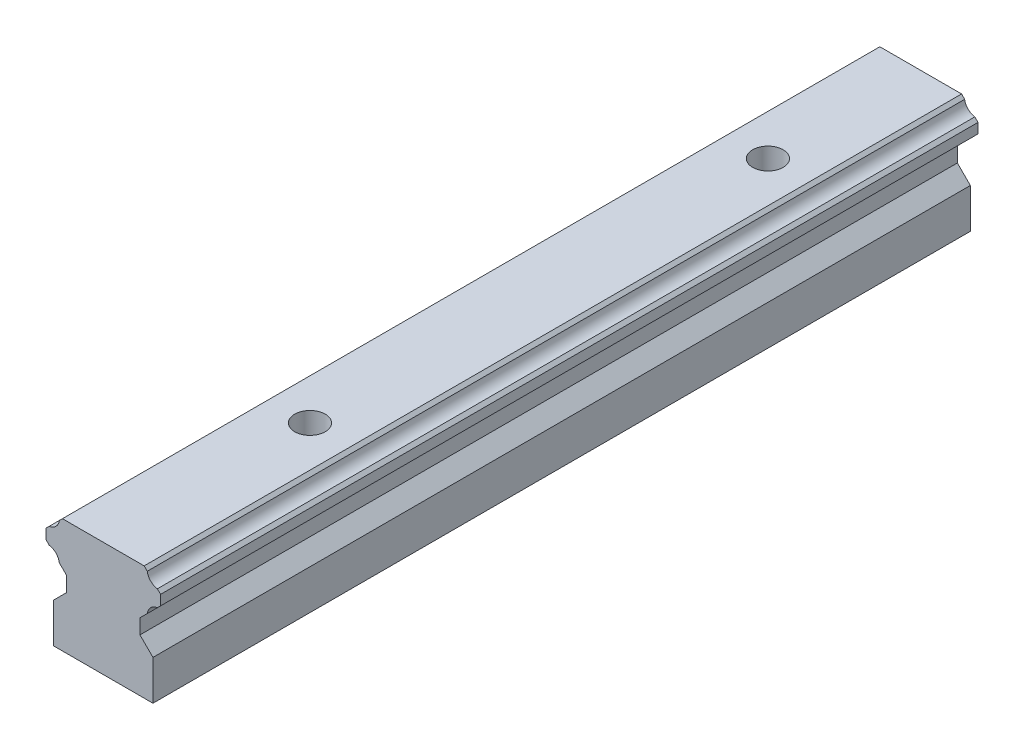
ISO-10303-21;
HEADER;
FILE_DESCRIPTION(('STEP AP214'),'2;1');
FILE_NAME('part.step','',(''),(''),'','','');
FILE_SCHEMA(('AUTOMOTIVE_DESIGN { 1 0 10303 214 1 1 1 1 }'));
ENDSEC;
DATA;
#1=APPLICATION_CONTEXT('core data for automotive mechanical design processes');
#2=APPLICATION_PROTOCOL_DEFINITION('international standard','automotive_design',2000,#1);
#3=PRODUCT_CONTEXT('',#1,'mechanical');
#4=PRODUCT('Part','Part','',(#3));
#5=PRODUCT_RELATED_PRODUCT_CATEGORY('part','',(#4));
#6=PRODUCT_DEFINITION_FORMATION('','',#4);
#7=PRODUCT_DEFINITION_CONTEXT('part definition',#1,'design');
#8=PRODUCT_DEFINITION('design','',#6,#7);
#9=PRODUCT_DEFINITION_SHAPE('','',#8);
#10=(LENGTH_UNIT() NAMED_UNIT(*) SI_UNIT(.MILLI.,.METRE.));
#11=(NAMED_UNIT(*) PLANE_ANGLE_UNIT() SI_UNIT($,.RADIAN.));
#12=(NAMED_UNIT(*) SI_UNIT($,.STERADIAN.) SOLID_ANGLE_UNIT());
#13=UNCERTAINTY_MEASURE_WITH_UNIT(LENGTH_MEASURE(1.E-05),#10,'distance_accuracy_value','');
#14=(GEOMETRIC_REPRESENTATION_CONTEXT(3) GLOBAL_UNCERTAINTY_ASSIGNED_CONTEXT((#13)) GLOBAL_UNIT_ASSIGNED_CONTEXT((#10,
#11,#12)) REPRESENTATION_CONTEXT('',''));
#15=CARTESIAN_POINT('',(0.,0.,0.));
#16=DIRECTION('',(0.,0.,1.));
#17=DIRECTION('',(1.,0.,0.));
#18=AXIS2_PLACEMENT_3D('',#15,#16,#17);
#19=CARTESIAN_POINT('',(-6.5,5.20000000000005,107.00004));
#20=DIRECTION('',(0.707106781186547,-0.707106781186547,0.));
#21=DIRECTION('',(0.707106781186548,0.707106781186548,0.));
#22=AXIS2_PLACEMENT_3D('',#19,#20,#21);
#23=PLANE('',#22);
#24=DIRECTION('',(-0.707106781186547,-0.707106781186547,0.));
#25=VECTOR('',#24,1.);
#26=CARTESIAN_POINT('',(-6.5,5.20000000000005,0.));
#27=LINE('',#26,#25);
#28=CARTESIAN_POINT('',(-4.8,6.90000000000005,0.));
#29=VERTEX_POINT('',#28);
#30=CARTESIAN_POINT('',(-6.5,5.20000000000005,0.));
#31=VERTEX_POINT('',#30);
#32=EDGE_CURVE('E214',#29,#31,#27,.T.);
#33=ORIENTED_EDGE('',*,*,#32,.T.);
#34=DIRECTION('',(0.,0.,-1.));
#35=VECTOR('',#34,1.);
#36=CARTESIAN_POINT('',(-6.5,5.20000000000005,107.00004));
#37=LINE('',#36,#35);
#38=CARTESIAN_POINT('',(-6.5,5.20000000000005,107.00004));
#39=VERTEX_POINT('',#38);
#40=EDGE_CURVE('E11',#39,#31,#37,.T.);
#41=ORIENTED_EDGE('',*,*,#40,.F.);
#42=DIRECTION('',(-0.707106781186547,-0.707106781186547,0.));
#43=VECTOR('',#42,1.);
#44=CARTESIAN_POINT('',(-6.5,5.20000000000005,107.00004));
#45=LINE('',#44,#43);
#46=CARTESIAN_POINT('',(-4.8,6.90000000000005,107.00004));
#47=VERTEX_POINT('',#46);
#48=EDGE_CURVE('E257',#47,#39,#45,.T.);
#49=ORIENTED_EDGE('',*,*,#48,.F.);
#50=DIRECTION('',(0.,0.,-1.));
#51=VECTOR('',#50,1.);
#52=CARTESIAN_POINT('',(-4.8,6.90000000000005,107.00004));
#53=LINE('',#52,#51);
#54=EDGE_CURVE('E210',#47,#29,#53,.T.);
#55=ORIENTED_EDGE('',*,*,#54,.T.);
#56=EDGE_LOOP('',(#33,#41,#49,#55));
#57=FACE_BOUND('',#56,.T.);
#58=ADVANCED_FACE('F34',(#57),#23,.F.);
#59=CARTESIAN_POINT('',(-6.5,5.20000000000005,107.00004));
#60=DIRECTION('',(1.,0.,0.));
#61=DIRECTION('',(0.,0.,-1.));
#62=AXIS2_PLACEMENT_3D('',#59,#60,#61);
#63=PLANE('',#62);
#64=DIRECTION('',(0.,-1.,0.));
#65=VECTOR('',#64,1.);
#66=CARTESIAN_POINT('',(-6.5,5.20000000000005,0.));
#67=LINE('',#66,#65);
#68=CARTESIAN_POINT('',(-6.5,0.,0.));
#69=VERTEX_POINT('',#68);
#70=EDGE_CURVE('E217',#31,#69,#67,.T.);
#71=ORIENTED_EDGE('',*,*,#70,.T.);
#72=DIRECTION('',(0.,0.,-1.));
#73=VECTOR('',#72,1.);
#74=CARTESIAN_POINT('',(-6.5,0.,107.00004));
#75=LINE('',#74,#73);
#76=CARTESIAN_POINT('',(-6.5,0.,107.00004));
#77=VERTEX_POINT('',#76);
#78=EDGE_CURVE('E42',#77,#69,#75,.T.);
#79=ORIENTED_EDGE('',*,*,#78,.F.);
#80=DIRECTION('',(0.,-1.,0.));
#81=VECTOR('',#80,1.);
#82=CARTESIAN_POINT('',(-6.5,5.20000000000005,107.00004));
#83=LINE('',#82,#81);
#84=EDGE_CURVE('E135',#39,#77,#83,.T.);
#85=ORIENTED_EDGE('',*,*,#84,.F.);
#86=ORIENTED_EDGE('',*,*,#40,.T.);
#87=EDGE_LOOP('',(#71,#79,#85,#86));
#88=FACE_BOUND('',#87,.T.);
#89=ADVANCED_FACE('F385',(#88),#63,.F.);
#90=CARTESIAN_POINT('',(-6.5,0.,107.00004));
#91=DIRECTION('',(0.,1.,0.));
#92=DIRECTION('',(0.,0.,1.));
#93=AXIS2_PLACEMENT_3D('',#90,#91,#92);
#94=PLANE('',#93);
#95=CARTESIAN_POINT('',(0.,0.,20.));
#96=DIRECTION('',(0.,1.,0.));
#97=DIRECTION('',(0.,0.,1.));
#98=AXIS2_PLACEMENT_3D('',#95,#96,#97);
#99=CIRCLE('',#98,2.);
#100=CARTESIAN_POINT('',(0.,0.,22.));
#101=VERTEX_POINT('',#100);
#102=EDGE_CURVE('E218',#101,#101,#99,.T.);
#103=ORIENTED_EDGE('',*,*,#102,.T.);
#104=EDGE_LOOP('',(#103));
#105=FACE_BOUND('',#104,.T.);
#106=CARTESIAN_POINT('',(0.,0.,79.944));
#107=DIRECTION('',(0.,1.,0.));
#108=DIRECTION('',(0.,0.,1.));
#109=AXIS2_PLACEMENT_3D('',#106,#107,#108);
#110=CIRCLE('',#109,2.);
#111=CARTESIAN_POINT('',(0.,0.,81.944));
#112=VERTEX_POINT('',#111);
#113=EDGE_CURVE('E523',#112,#112,#110,.T.);
#114=ORIENTED_EDGE('',*,*,#113,.T.);
#115=EDGE_LOOP('',(#114));
#116=FACE_BOUND('',#115,.T.);
#117=DIRECTION('',(1.,0.,0.));
#118=VECTOR('',#117,1.);
#119=CARTESIAN_POINT('',(-6.5,0.,0.));
#120=LINE('',#119,#118);
#121=CARTESIAN_POINT('',(6.5,0.,0.));
#122=VERTEX_POINT('',#121);
#123=EDGE_CURVE('E220',#69,#122,#120,.T.);
#124=ORIENTED_EDGE('',*,*,#123,.T.);
#125=DIRECTION('',(0.,0.,-1.));
#126=VECTOR('',#125,1.);
#127=CARTESIAN_POINT('',(6.5,0.,107.00004));
#128=LINE('',#127,#126);
#129=CARTESIAN_POINT('',(6.5,0.,107.00004));
#130=VERTEX_POINT('',#129);
#131=EDGE_CURVE('E306',#130,#122,#128,.T.);
#132=ORIENTED_EDGE('',*,*,#131,.F.);
#133=DIRECTION('',(1.,0.,0.));
#134=VECTOR('',#133,1.);
#135=CARTESIAN_POINT('',(-6.5,0.,107.00004));
#136=LINE('',#135,#134);
#137=EDGE_CURVE('E314',#77,#130,#136,.T.);
#138=ORIENTED_EDGE('',*,*,#137,.F.);
#139=ORIENTED_EDGE('',*,*,#78,.T.);
#140=EDGE_LOOP('',(#124,#132,#138,#139));
#141=FACE_BOUND('',#140,.T.);
#142=ADVANCED_FACE('F312',(#105,#116,#141),#94,.F.);
#143=CARTESIAN_POINT('',(6.5,5.20000000000005,107.00004));
#144=DIRECTION('',(-1.,0.,0.));
#145=DIRECTION('',(0.,0.,1.));
#146=AXIS2_PLACEMENT_3D('',#143,#144,#145);
#147=PLANE('',#146);
#148=DIRECTION('',(0.,1.,0.));
#149=VECTOR('',#148,1.);
#150=CARTESIAN_POINT('',(6.5,5.20000000000005,0.));
#151=LINE('',#150,#149);
#152=CARTESIAN_POINT('',(6.5,5.20000000000005,0.));
#153=VERTEX_POINT('',#152);
#154=EDGE_CURVE('E222',#122,#153,#151,.T.);
#155=ORIENTED_EDGE('',*,*,#154,.T.);
#156=DIRECTION('',(0.,0.,-1.));
#157=VECTOR('',#156,1.);
#158=CARTESIAN_POINT('',(6.5,5.20000000000005,107.00004));
#159=LINE('',#158,#157);
#160=CARTESIAN_POINT('',(6.5,5.20000000000005,107.00004));
#161=VERTEX_POINT('',#160);
#162=EDGE_CURVE('E303',#161,#153,#159,.T.);
#163=ORIENTED_EDGE('',*,*,#162,.F.);
#164=DIRECTION('',(0.,1.,0.));
#165=VECTOR('',#164,1.);
#166=CARTESIAN_POINT('',(6.5,5.20000000000005,107.00004));
#167=LINE('',#166,#165);
#168=EDGE_CURVE('E332',#130,#161,#167,.T.);
#169=ORIENTED_EDGE('',*,*,#168,.F.);
#170=ORIENTED_EDGE('',*,*,#131,.T.);
#171=EDGE_LOOP('',(#155,#163,#169,#170));
#172=FACE_BOUND('',#171,.T.);
#173=ADVANCED_FACE('F323',(#172),#147,.F.);
#174=CARTESIAN_POINT('',(4.8,6.90000000000005,107.00004));
#175=DIRECTION('',(-0.707106781186547,-0.707106781186547,0.));
#176=DIRECTION('',(0.707106781186548,-0.707106781186548,0.));
#177=AXIS2_PLACEMENT_3D('',#174,#175,#176);
#178=PLANE('',#177);
#179=DIRECTION('',(-0.707106781186547,0.707106781186547,0.));
#180=VECTOR('',#179,1.);
#181=CARTESIAN_POINT('',(4.8,6.90000000000005,0.));
#182=LINE('',#181,#180);
#183=CARTESIAN_POINT('',(4.8,6.90000000000005,0.));
#184=VERTEX_POINT('',#183);
#185=EDGE_CURVE('E224',#153,#184,#182,.T.);
#186=ORIENTED_EDGE('',*,*,#185,.T.);
#187=DIRECTION('',(0.,0.,-1.));
#188=VECTOR('',#187,1.);
#189=CARTESIAN_POINT('',(4.8,6.90000000000005,107.00004));
#190=LINE('',#189,#188);
#191=CARTESIAN_POINT('',(4.8,6.90000000000005,107.00004));
#192=VERTEX_POINT('',#191);
#193=EDGE_CURVE('E300',#192,#184,#190,.T.);
#194=ORIENTED_EDGE('',*,*,#193,.F.);
#195=DIRECTION('',(-0.707106781186547,0.707106781186547,0.));
#196=VECTOR('',#195,1.);
#197=CARTESIAN_POINT('',(4.8,6.90000000000005,107.00004));
#198=LINE('',#197,#196);
#199=EDGE_CURVE('E329',#161,#192,#198,.T.);
#200=ORIENTED_EDGE('',*,*,#199,.F.);
#201=ORIENTED_EDGE('',*,*,#162,.T.);
#202=EDGE_LOOP('',(#186,#194,#200,#201));
#203=FACE_BOUND('',#202,.T.);
#204=ADVANCED_FACE('F327',(#203),#178,.F.);
#205=CARTESIAN_POINT('',(4.8,8.84000000000005,107.00004));
#206=DIRECTION('',(-1.,0.,0.));
#207=DIRECTION('',(0.,0.,1.));
#208=AXIS2_PLACEMENT_3D('',#205,#206,#207);
#209=PLANE('',#208);
#210=DIRECTION('',(0.,1.,0.));
#211=VECTOR('',#210,1.);
#212=CARTESIAN_POINT('',(4.8,8.84000000000005,0.));
#213=LINE('',#212,#211);
#214=CARTESIAN_POINT('',(4.8,8.84000000000005,0.));
#215=VERTEX_POINT('',#214);
#216=EDGE_CURVE('E226',#184,#215,#213,.T.);
#217=ORIENTED_EDGE('',*,*,#216,.T.);
#218=DIRECTION('',(0.,0.,-1.));
#219=VECTOR('',#218,1.);
#220=CARTESIAN_POINT('',(4.8,8.84000000000005,107.00004));
#221=LINE('',#220,#219);
#222=CARTESIAN_POINT('',(4.8,8.84000000000005,107.00004));
#223=VERTEX_POINT('',#222);
#224=EDGE_CURVE('E297',#223,#215,#221,.T.);
#225=ORIENTED_EDGE('',*,*,#224,.F.);
#226=DIRECTION('',(0.,1.,0.));
#227=VECTOR('',#226,1.);
#228=CARTESIAN_POINT('',(4.8,8.84000000000005,107.00004));
#229=LINE('',#228,#227);
#230=EDGE_CURVE('E331',#192,#223,#229,.T.);
#231=ORIENTED_EDGE('',*,*,#230,.F.);
#232=ORIENTED_EDGE('',*,*,#193,.T.);
#233=EDGE_LOOP('',(#217,#225,#231,#232));
#234=FACE_BOUND('',#233,.T.);
#235=ADVANCED_FACE('F399',(#234),#209,.F.);
#236=CARTESIAN_POINT('',(5.7548684340674,9.79486843406745,107.00004));
#237=DIRECTION('',(-0.707106781186548,0.707106781186547,0.));
#238=DIRECTION('',(-0.707106781186547,-0.707106781186548,0.));
#239=AXIS2_PLACEMENT_3D('',#236,#237,#238);
#240=PLANE('',#239);
#241=DIRECTION('',(0.707106781186547,0.707106781186548,0.));
#242=VECTOR('',#241,1.);
#243=CARTESIAN_POINT('',(5.7548684340674,9.79486843406745,0.));
#244=LINE('',#243,#242);
#245=CARTESIAN_POINT('',(5.7548684340674,9.79486843406745,0.));
#246=VERTEX_POINT('',#245);
#247=EDGE_CURVE('E228',#215,#246,#244,.T.);
#248=ORIENTED_EDGE('',*,*,#247,.T.);
#249=DIRECTION('',(0.,0.,-1.));
#250=VECTOR('',#249,1.);
#251=CARTESIAN_POINT('',(5.7548684340674,9.79486843406745,107.00004));
#252=LINE('',#251,#250);
#253=CARTESIAN_POINT('',(5.7548684340674,9.79486843406745,107.00004));
#254=VERTEX_POINT('',#253);
#255=EDGE_CURVE('E294',#254,#246,#252,.T.);
#256=ORIENTED_EDGE('',*,*,#255,.F.);
#257=DIRECTION('',(0.707106781186547,0.707106781186548,0.));
#258=VECTOR('',#257,1.);
#259=CARTESIAN_POINT('',(5.7548684340674,9.79486843406745,107.00004));
#260=LINE('',#259,#258);
#261=EDGE_CURVE('E334',#223,#254,#260,.T.);
#262=ORIENTED_EDGE('',*,*,#261,.F.);
#263=ORIENTED_EDGE('',*,*,#224,.T.);
#264=EDGE_LOOP('',(#248,#256,#262,#263));
#265=FACE_BOUND('',#264,.T.);
#266=ADVANCED_FACE('F402',(#265),#240,.F.);
#267=CARTESIAN_POINT('',(7.29999999999997,9.58000000000008,107.00004));
#268=DIRECTION('',(0.,0.,-1.));
#269=DIRECTION('',(-1.,0.,0.));
#270=AXIS2_PLACEMENT_3D('',#267,#268,#269);
#271=CYLINDRICAL_SURFACE('',#270,1.55999999999993);
#272=CARTESIAN_POINT('',(7.29999999999997,9.58000000000008,0.));
#273=DIRECTION('',(0.,0.,-1.));
#274=DIRECTION('',(1.,0.,0.));
#275=AXIS2_PLACEMENT_3D('',#272,#273,#274);
#276=CIRCLE('',#275,1.55999999999993);
#277=CARTESIAN_POINT('',(7.0851315659326,11.1251315659326,0.));
#278=VERTEX_POINT('',#277);
#279=EDGE_CURVE('E230',#246,#278,#276,.T.);
#280=ORIENTED_EDGE('',*,*,#279,.T.);
#281=DIRECTION('',(0.,0.,-1.));
#282=VECTOR('',#281,1.);
#283=CARTESIAN_POINT('',(7.0851315659326,11.1251315659326,107.00004));
#284=LINE('',#283,#282);
#285=CARTESIAN_POINT('',(7.0851315659326,11.1251315659326,107.00004));
#286=VERTEX_POINT('',#285);
#287=EDGE_CURVE('E291',#286,#278,#284,.T.);
#288=ORIENTED_EDGE('',*,*,#287,.F.);
#289=CARTESIAN_POINT('',(7.29999999999997,9.58000000000008,107.00004));
#290=DIRECTION('',(0.,0.,-1.));
#291=DIRECTION('',(1.,0.,0.));
#292=AXIS2_PLACEMENT_3D('',#289,#290,#291);
#293=CIRCLE('',#292,1.55999999999993);
#294=EDGE_CURVE('E340',#254,#286,#293,.T.);
#295=ORIENTED_EDGE('',*,*,#294,.F.);
#296=ORIENTED_EDGE('',*,*,#255,.T.);
#297=EDGE_LOOP('',(#280,#288,#295,#296));
#298=FACE_BOUND('',#297,.T.);
#299=ADVANCED_FACE('F406',(#298),#271,.F.);
#300=CARTESIAN_POINT('',(7.5,11.54,107.00004));
#301=DIRECTION('',(-0.707106781186548,0.707106781186547,0.));
#302=DIRECTION('',(-0.707106781186547,-0.707106781186548,0.));
#303=AXIS2_PLACEMENT_3D('',#300,#301,#302);
#304=PLANE('',#303);
#305=DIRECTION('',(0.707106781186547,0.707106781186548,0.));
#306=VECTOR('',#305,1.);
#307=CARTESIAN_POINT('',(7.5,11.54,0.));
#308=LINE('',#307,#306);
#309=CARTESIAN_POINT('',(7.5,11.54,0.));
#310=VERTEX_POINT('',#309);
#311=EDGE_CURVE('E232',#278,#310,#308,.T.);
#312=ORIENTED_EDGE('',*,*,#311,.T.);
#313=DIRECTION('',(0.,0.,-1.));
#314=VECTOR('',#313,1.);
#315=CARTESIAN_POINT('',(7.5,11.54,107.00004));
#316=LINE('',#315,#314);
#317=CARTESIAN_POINT('',(7.5,11.54,107.00004));
#318=VERTEX_POINT('',#317);
#319=EDGE_CURVE('E288',#318,#310,#316,.T.);
#320=ORIENTED_EDGE('',*,*,#319,.F.);
#321=DIRECTION('',(0.707106781186547,0.707106781186548,0.));
#322=VECTOR('',#321,1.);
#323=CARTESIAN_POINT('',(7.5,11.54,107.00004));
#324=LINE('',#323,#322);
#325=EDGE_CURVE('E342',#286,#318,#324,.T.);
#326=ORIENTED_EDGE('',*,*,#325,.F.);
#327=ORIENTED_EDGE('',*,*,#287,.T.);
#328=EDGE_LOOP('',(#312,#320,#326,#327));
#329=FACE_BOUND('',#328,.T.);
#330=ADVANCED_FACE('F410',(#329),#304,.F.);
#331=CARTESIAN_POINT('',(7.5,12.85,107.00004));
#332=DIRECTION('',(-1.,0.,0.));
#333=DIRECTION('',(0.,0.,1.));
#334=AXIS2_PLACEMENT_3D('',#331,#332,#333);
#335=PLANE('',#334);
#336=DIRECTION('',(0.,1.,0.));
#337=VECTOR('',#336,1.);
#338=CARTESIAN_POINT('',(7.5,12.85,0.));
#339=LINE('',#338,#337);
#340=CARTESIAN_POINT('',(7.5,12.85,0.));
#341=VERTEX_POINT('',#340);
#342=EDGE_CURVE('E234',#310,#341,#339,.T.);
#343=ORIENTED_EDGE('',*,*,#342,.T.);
#344=DIRECTION('',(0.,0.,-1.));
#345=VECTOR('',#344,1.);
#346=CARTESIAN_POINT('',(7.5,12.85,107.00004));
#347=LINE('',#346,#345);
#348=CARTESIAN_POINT('',(7.5,12.85,107.00004));
#349=VERTEX_POINT('',#348);
#350=EDGE_CURVE('E285',#349,#341,#347,.T.);
#351=ORIENTED_EDGE('',*,*,#350,.F.);
#352=DIRECTION('',(0.,1.,0.));
#353=VECTOR('',#352,1.);
#354=CARTESIAN_POINT('',(7.5,12.85,107.00004));
#355=LINE('',#354,#353);
#356=EDGE_CURVE('E344',#318,#349,#355,.T.);
#357=ORIENTED_EDGE('',*,*,#356,.F.);
#358=ORIENTED_EDGE('',*,*,#319,.T.);
#359=EDGE_LOOP('',(#343,#351,#357,#358));
#360=FACE_BOUND('',#359,.T.);
#361=ADVANCED_FACE('F414',(#360),#335,.F.);
#362=CARTESIAN_POINT('',(7.0816423301223,13.2683576698777,107.00004));
#363=DIRECTION('',(-0.707106781186549,-0.707106781186546,0.));
#364=DIRECTION('',(0.707106781186546,-0.707106781186549,0.));
#365=AXIS2_PLACEMENT_3D('',#362,#363,#364);
#366=PLANE('',#365);
#367=DIRECTION('',(-0.707106781186546,0.707106781186549,0.));
#368=VECTOR('',#367,1.);
#369=CARTESIAN_POINT('',(7.0816423301223,13.2683576698777,0.));
#370=LINE('',#369,#368);
#371=CARTESIAN_POINT('',(7.0816423301223,13.2683576698777,0.));
#372=VERTEX_POINT('',#371);
#373=EDGE_CURVE('E236',#341,#372,#370,.T.);
#374=ORIENTED_EDGE('',*,*,#373,.T.);
#375=DIRECTION('',(0.,0.,-1.));
#376=VECTOR('',#375,1.);
#377=CARTESIAN_POINT('',(7.0816423301223,13.2683576698777,107.00004));
#378=LINE('',#377,#376);
#379=CARTESIAN_POINT('',(7.0816423301223,13.2683576698777,107.00004));
#380=VERTEX_POINT('',#379);
#381=EDGE_CURVE('E282',#380,#372,#378,.T.);
#382=ORIENTED_EDGE('',*,*,#381,.F.);
#383=DIRECTION('',(-0.707106781186546,0.707106781186549,0.));
#384=VECTOR('',#383,1.);
#385=CARTESIAN_POINT('',(7.0816423301223,13.2683576698777,107.00004));
#386=LINE('',#385,#384);
#387=EDGE_CURVE('E346',#349,#380,#386,.T.);
#388=ORIENTED_EDGE('',*,*,#387,.F.);
#389=ORIENTED_EDGE('',*,*,#350,.T.);
#390=EDGE_LOOP('',(#374,#382,#388,#389));
#391=FACE_BOUND('',#390,.T.);
#392=ADVANCED_FACE('F418',(#391),#366,.F.);
#393=CARTESIAN_POINT('',(7.30000000000014,14.8130000000002,107.00004));
#394=DIRECTION('',(0.,0.,-1.));
#395=DIRECTION('',(-1.,0.,0.));
#396=AXIS2_PLACEMENT_3D('',#393,#394,#395);
#397=CYLINDRICAL_SURFACE('',#396,1.56000000000018);
#398=CARTESIAN_POINT('',(7.30000000000014,14.8130000000002,0.));
#399=DIRECTION('',(0.,0.,-1.));
#400=DIRECTION('',(1.,0.,0.));
#401=AXIS2_PLACEMENT_3D('',#398,#399,#400);
#402=CIRCLE('',#401,1.56000000000018);
#403=CARTESIAN_POINT('',(5.7553576698777,14.5946423301223,0.));
#404=VERTEX_POINT('',#403);
#405=EDGE_CURVE('E238',#372,#404,#402,.T.);
#406=ORIENTED_EDGE('',*,*,#405,.T.);
#407=DIRECTION('',(0.,0.,-1.));
#408=VECTOR('',#407,1.);
#409=CARTESIAN_POINT('',(5.7553576698777,14.5946423301223,107.00004));
#410=LINE('',#409,#408);
#411=CARTESIAN_POINT('',(5.7553576698777,14.5946423301223,107.00004));
#412=VERTEX_POINT('',#411);
#413=EDGE_CURVE('E279',#412,#404,#410,.T.);
#414=ORIENTED_EDGE('',*,*,#413,.F.);
#415=CARTESIAN_POINT('',(7.30000000000014,14.8130000000002,107.00004));
#416=DIRECTION('',(0.,0.,-1.));
#417=DIRECTION('',(1.,0.,0.));
#418=AXIS2_PLACEMENT_3D('',#415,#416,#417);
#419=CIRCLE('',#418,1.56000000000018);
#420=EDGE_CURVE('E348',#380,#412,#419,.T.);
#421=ORIENTED_EDGE('',*,*,#420,.F.);
#422=ORIENTED_EDGE('',*,*,#381,.T.);
#423=EDGE_LOOP('',(#406,#414,#421,#422));
#424=FACE_BOUND('',#423,.T.);
#425=ADVANCED_FACE('F422',(#424),#397,.F.);
#426=CARTESIAN_POINT('',(5.35,15.,107.00004));
#427=DIRECTION('',(-0.707106781186549,-0.707106781186546,0.));
#428=DIRECTION('',(0.707106781186546,-0.707106781186549,0.));
#429=AXIS2_PLACEMENT_3D('',#426,#427,#428);
#430=PLANE('',#429);
#431=DIRECTION('',(-0.707106781186546,0.707106781186549,0.));
#432=VECTOR('',#431,1.);
#433=CARTESIAN_POINT('',(5.35,15.,0.));
#434=LINE('',#433,#432);
#435=CARTESIAN_POINT('',(5.35,15.,0.));
#436=VERTEX_POINT('',#435);
#437=EDGE_CURVE('E240',#404,#436,#434,.T.);
#438=ORIENTED_EDGE('',*,*,#437,.T.);
#439=DIRECTION('',(0.,0.,-1.));
#440=VECTOR('',#439,1.);
#441=CARTESIAN_POINT('',(5.35,15.,107.00004));
#442=LINE('',#441,#440);
#443=CARTESIAN_POINT('',(5.35,15.,107.00004));
#444=VERTEX_POINT('',#443);
#445=EDGE_CURVE('E276',#444,#436,#442,.T.);
#446=ORIENTED_EDGE('',*,*,#445,.F.);
#447=DIRECTION('',(-0.707106781186546,0.707106781186549,0.));
#448=VECTOR('',#447,1.);
#449=CARTESIAN_POINT('',(5.35,15.,107.00004));
#450=LINE('',#449,#448);
#451=EDGE_CURVE('E350',#412,#444,#450,.T.);
#452=ORIENTED_EDGE('',*,*,#451,.F.);
#453=ORIENTED_EDGE('',*,*,#413,.T.);
#454=EDGE_LOOP('',(#438,#446,#452,#453));
#455=FACE_BOUND('',#454,.T.);
#456=ADVANCED_FACE('F426',(#455),#430,.F.);
#457=CARTESIAN_POINT('',(-5.35,15.,107.00004));
#458=DIRECTION('',(0.,-1.,0.));
#459=DIRECTION('',(0.,0.,-1.));
#460=AXIS2_PLACEMENT_3D('',#457,#458,#459);
#461=PLANE('',#460);
#462=CARTESIAN_POINT('',(0.,15.,20.));
#463=DIRECTION('',(0.,1.,0.));
#464=DIRECTION('',(0.,0.,1.));
#465=AXIS2_PLACEMENT_3D('',#462,#463,#464);
#466=CIRCLE('',#465,2.);
#467=CARTESIAN_POINT('',(0.,15.,22.));
#468=VERTEX_POINT('',#467);
#469=EDGE_CURVE('E522',#468,#468,#466,.T.);
#470=ORIENTED_EDGE('',*,*,#469,.F.);
#471=EDGE_LOOP('',(#470));
#472=FACE_BOUND('',#471,.T.);
#473=CARTESIAN_POINT('',(0.,15.,79.944));
#474=DIRECTION('',(0.,1.,0.));
#475=DIRECTION('',(0.,0.,1.));
#476=AXIS2_PLACEMENT_3D('',#473,#474,#475);
#477=CIRCLE('',#476,2.);
#478=CARTESIAN_POINT('',(0.,15.,81.944));
#479=VERTEX_POINT('',#478);
#480=EDGE_CURVE('E527',#479,#479,#477,.T.);
#481=ORIENTED_EDGE('',*,*,#480,.F.);
#482=EDGE_LOOP('',(#481));
#483=FACE_BOUND('',#482,.T.);
#484=DIRECTION('',(-1.,0.,0.));
#485=VECTOR('',#484,1.);
#486=CARTESIAN_POINT('',(-5.35,15.,0.));
#487=LINE('',#486,#485);
#488=CARTESIAN_POINT('',(-5.35,15.,0.));
#489=VERTEX_POINT('',#488);
#490=EDGE_CURVE('E242',#436,#489,#487,.T.);
#491=ORIENTED_EDGE('',*,*,#490,.T.);
#492=DIRECTION('',(0.,0.,-1.));
#493=VECTOR('',#492,1.);
#494=CARTESIAN_POINT('',(-5.35,15.,107.00004));
#495=LINE('',#494,#493);
#496=CARTESIAN_POINT('',(-5.35,15.,107.00004));
#497=VERTEX_POINT('',#496);
#498=EDGE_CURVE('E273',#497,#489,#495,.T.);
#499=ORIENTED_EDGE('',*,*,#498,.F.);
#500=DIRECTION('',(-1.,0.,0.));
#501=VECTOR('',#500,1.);
#502=CARTESIAN_POINT('',(-5.35,15.,107.00004));
#503=LINE('',#502,#501);
#504=EDGE_CURVE('E352',#444,#497,#503,.T.);
#505=ORIENTED_EDGE('',*,*,#504,.F.);
#506=ORIENTED_EDGE('',*,*,#445,.T.);
#507=EDGE_LOOP('',(#491,#499,#505,#506));
#508=FACE_BOUND('',#507,.T.);
#509=ADVANCED_FACE('F430',(#472,#483,#508),#461,.F.);
#510=CARTESIAN_POINT('',(-5.7553576698777,14.5946423301223,107.00004));
#511=DIRECTION('',(0.707106781186547,-0.707106781186547,0.));
#512=DIRECTION('',(0.707106781186548,0.707106781186548,0.));
#513=AXIS2_PLACEMENT_3D('',#510,#511,#512);
#514=PLANE('',#513);
#515=DIRECTION('',(-0.707106781186547,-0.707106781186547,0.));
#516=VECTOR('',#515,1.);
#517=CARTESIAN_POINT('',(-5.7553576698777,14.5946423301223,0.));
#518=LINE('',#517,#516);
#519=CARTESIAN_POINT('',(-5.7553576698777,14.5946423301223,0.));
#520=VERTEX_POINT('',#519);
#521=EDGE_CURVE('E244',#489,#520,#518,.T.);
#522=ORIENTED_EDGE('',*,*,#521,.T.);
#523=DIRECTION('',(0.,0.,-1.));
#524=VECTOR('',#523,1.);
#525=CARTESIAN_POINT('',(-5.7553576698777,14.5946423301223,107.00004));
#526=LINE('',#525,#524);
#527=CARTESIAN_POINT('',(-5.7553576698777,14.5946423301223,107.00004));
#528=VERTEX_POINT('',#527);
#529=EDGE_CURVE('E270',#528,#520,#526,.T.);
#530=ORIENTED_EDGE('',*,*,#529,.F.);
#531=DIRECTION('',(-0.707106781186547,-0.707106781186547,0.));
#532=VECTOR('',#531,1.);
#533=CARTESIAN_POINT('',(-5.7553576698777,14.5946423301223,107.00004));
#534=LINE('',#533,#532);
#535=EDGE_CURVE('E354',#497,#528,#534,.T.);
#536=ORIENTED_EDGE('',*,*,#535,.F.);
#537=ORIENTED_EDGE('',*,*,#498,.T.);
#538=EDGE_LOOP('',(#522,#530,#536,#537));
#539=FACE_BOUND('',#538,.T.);
#540=ADVANCED_FACE('F434',(#539),#514,.F.);
#541=CARTESIAN_POINT('',(-7.30000000000015,14.8130000000002,107.00004));
#542=DIRECTION('',(0.,0.,-1.));
#543=DIRECTION('',(-1.,0.,0.));
#544=AXIS2_PLACEMENT_3D('',#541,#542,#543);
#545=CYLINDRICAL_SURFACE('',#544,1.56000000000019);
#546=CARTESIAN_POINT('',(-7.30000000000015,14.8130000000002,0.));
#547=DIRECTION('',(0.,0.,-1.));
#548=DIRECTION('',(1.,0.,0.));
#549=AXIS2_PLACEMENT_3D('',#546,#547,#548);
#550=CIRCLE('',#549,1.56000000000019);
#551=CARTESIAN_POINT('',(-7.0816423301223,13.2683576698777,0.));
#552=VERTEX_POINT('',#551);
#553=EDGE_CURVE('E246',#520,#552,#550,.T.);
#554=ORIENTED_EDGE('',*,*,#553,.T.);
#555=DIRECTION('',(0.,0.,-1.));
#556=VECTOR('',#555,1.);
#557=CARTESIAN_POINT('',(-7.0816423301223,13.2683576698777,107.00004));
#558=LINE('',#557,#556);
#559=CARTESIAN_POINT('',(-7.0816423301223,13.2683576698777,107.00004));
#560=VERTEX_POINT('',#559);
#561=EDGE_CURVE('E267',#560,#552,#558,.T.);
#562=ORIENTED_EDGE('',*,*,#561,.F.);
#563=CARTESIAN_POINT('',(-7.30000000000015,14.8130000000002,107.00004));
#564=DIRECTION('',(0.,0.,-1.));
#565=DIRECTION('',(1.,0.,0.));
#566=AXIS2_PLACEMENT_3D('',#563,#564,#565);
#567=CIRCLE('',#566,1.56000000000019);
#568=EDGE_CURVE('E356',#528,#560,#567,.T.);
#569=ORIENTED_EDGE('',*,*,#568,.F.);
#570=ORIENTED_EDGE('',*,*,#529,.T.);
#571=EDGE_LOOP('',(#554,#562,#569,#570));
#572=FACE_BOUND('',#571,.T.);
#573=ADVANCED_FACE('F438',(#572),#545,.F.);
#574=CARTESIAN_POINT('',(-7.5,12.85,107.00004));
#575=DIRECTION('',(0.707106781186549,-0.707106781186546,0.));
#576=DIRECTION('',(0.707106781186546,0.707106781186549,0.));
#577=AXIS2_PLACEMENT_3D('',#574,#575,#576);
#578=PLANE('',#577);
#579=DIRECTION('',(-0.707106781186546,-0.707106781186549,0.));
#580=VECTOR('',#579,1.);
#581=CARTESIAN_POINT('',(-7.5,12.85,0.));
#582=LINE('',#581,#580);
#583=CARTESIAN_POINT('',(-7.5,12.85,0.));
#584=VERTEX_POINT('',#583);
#585=EDGE_CURVE('E248',#552,#584,#582,.T.);
#586=ORIENTED_EDGE('',*,*,#585,.T.);
#587=DIRECTION('',(0.,0.,-1.));
#588=VECTOR('',#587,1.);
#589=CARTESIAN_POINT('',(-7.5,12.85,107.00004));
#590=LINE('',#589,#588);
#591=CARTESIAN_POINT('',(-7.5,12.85,107.00004));
#592=VERTEX_POINT('',#591);
#593=EDGE_CURVE('E264',#592,#584,#590,.T.);
#594=ORIENTED_EDGE('',*,*,#593,.F.);
#595=DIRECTION('',(-0.707106781186546,-0.707106781186549,0.));
#596=VECTOR('',#595,1.);
#597=CARTESIAN_POINT('',(-7.5,12.85,107.00004));
#598=LINE('',#597,#596);
#599=EDGE_CURVE('E358',#560,#592,#598,.T.);
#600=ORIENTED_EDGE('',*,*,#599,.F.);
#601=ORIENTED_EDGE('',*,*,#561,.T.);
#602=EDGE_LOOP('',(#586,#594,#600,#601));
#603=FACE_BOUND('',#602,.T.);
#604=ADVANCED_FACE('F442',(#603),#578,.F.);
#605=CARTESIAN_POINT('',(-7.5,11.54,107.00004));
#606=DIRECTION('',(1.,0.,0.));
#607=DIRECTION('',(0.,0.,-1.));
#608=AXIS2_PLACEMENT_3D('',#605,#606,#607);
#609=PLANE('',#608);
#610=DIRECTION('',(0.,-1.,0.));
#611=VECTOR('',#610,1.);
#612=CARTESIAN_POINT('',(-7.5,11.54,0.));
#613=LINE('',#612,#611);
#614=CARTESIAN_POINT('',(-7.5,11.54,0.));
#615=VERTEX_POINT('',#614);
#616=EDGE_CURVE('E250',#584,#615,#613,.T.);
#617=ORIENTED_EDGE('',*,*,#616,.T.);
#618=DIRECTION('',(0.,0.,-1.));
#619=VECTOR('',#618,1.);
#620=CARTESIAN_POINT('',(-7.5,11.54,107.00004));
#621=LINE('',#620,#619);
#622=CARTESIAN_POINT('',(-7.5,11.54,107.00004));
#623=VERTEX_POINT('',#622);
#624=EDGE_CURVE('E261',#623,#615,#621,.T.);
#625=ORIENTED_EDGE('',*,*,#624,.F.);
#626=DIRECTION('',(0.,-1.,0.));
#627=VECTOR('',#626,1.);
#628=CARTESIAN_POINT('',(-7.5,11.54,107.00004));
#629=LINE('',#628,#627);
#630=EDGE_CURVE('E360',#592,#623,#629,.T.);
#631=ORIENTED_EDGE('',*,*,#630,.F.);
#632=ORIENTED_EDGE('',*,*,#593,.T.);
#633=EDGE_LOOP('',(#617,#625,#631,#632));
#634=FACE_BOUND('',#633,.T.);
#635=ADVANCED_FACE('F366',(#634),#609,.F.);
#636=CARTESIAN_POINT('',(-7.0851315659326,11.1251315659326,107.00004));
#637=DIRECTION('',(0.707106781186548,0.707106781186547,0.));
#638=DIRECTION('',(-0.707106781186547,0.707106781186548,0.));
#639=AXIS2_PLACEMENT_3D('',#636,#637,#638);
#640=PLANE('',#639);
#641=DIRECTION('',(0.707106781186547,-0.707106781186548,0.));
#642=VECTOR('',#641,1.);
#643=CARTESIAN_POINT('',(-7.0851315659326,11.1251315659326,0.));
#644=LINE('',#643,#642);
#645=CARTESIAN_POINT('',(-7.0851315659326,11.1251315659326,0.));
#646=VERTEX_POINT('',#645);
#647=EDGE_CURVE('E252',#615,#646,#644,.T.);
#648=ORIENTED_EDGE('',*,*,#647,.T.);
#649=DIRECTION('',(0.,0.,-1.));
#650=VECTOR('',#649,1.);
#651=CARTESIAN_POINT('',(-7.0851315659326,11.1251315659326,107.00004));
#652=LINE('',#651,#650);
#653=CARTESIAN_POINT('',(-7.0851315659326,11.1251315659326,107.00004));
#654=VERTEX_POINT('',#653);
#655=EDGE_CURVE('E205',#654,#646,#652,.T.);
#656=ORIENTED_EDGE('',*,*,#655,.F.);
#657=DIRECTION('',(0.707106781186547,-0.707106781186548,0.));
#658=VECTOR('',#657,1.);
#659=CARTESIAN_POINT('',(-7.0851315659326,11.1251315659326,107.00004));
#660=LINE('',#659,#658);
#661=EDGE_CURVE('E196',#623,#654,#660,.T.);
#662=ORIENTED_EDGE('',*,*,#661,.F.);
#663=ORIENTED_EDGE('',*,*,#624,.T.);
#664=EDGE_LOOP('',(#648,#656,#662,#663));
#665=FACE_BOUND('',#664,.T.);
#666=ADVANCED_FACE('F370',(#665),#640,.F.);
#667=CARTESIAN_POINT('',(-7.29999999999997,9.58000000000008,107.00004));
#668=DIRECTION('',(0.,0.,-1.));
#669=DIRECTION('',(-1.,0.,0.));
#670=AXIS2_PLACEMENT_3D('',#667,#668,#669);
#671=CYLINDRICAL_SURFACE('',#670,1.55999999999994);
#672=CARTESIAN_POINT('',(-7.29999999999997,9.58000000000008,0.));
#673=DIRECTION('',(0.,0.,-1.));
#674=DIRECTION('',(1.,0.,0.));
#675=AXIS2_PLACEMENT_3D('',#672,#673,#674);
#676=CIRCLE('',#675,1.55999999999994);
#677=CARTESIAN_POINT('',(-5.7548684340674,9.79486843406745,0.));
#678=VERTEX_POINT('',#677);
#679=EDGE_CURVE('E204',#646,#678,#676,.T.);
#680=ORIENTED_EDGE('',*,*,#679,.T.);
#681=DIRECTION('',(0.,0.,-1.));
#682=VECTOR('',#681,1.);
#683=CARTESIAN_POINT('',(-5.7548684340674,9.79486843406745,107.00004));
#684=LINE('',#683,#682);
#685=CARTESIAN_POINT('',(-5.7548684340674,9.79486843406745,107.00004));
#686=VERTEX_POINT('',#685);
#687=EDGE_CURVE('E201',#686,#678,#684,.T.);
#688=ORIENTED_EDGE('',*,*,#687,.F.);
#689=CARTESIAN_POINT('',(-7.29999999999997,9.58000000000008,107.00004));
#690=DIRECTION('',(0.,0.,-1.));
#691=DIRECTION('',(1.,0.,0.));
#692=AXIS2_PLACEMENT_3D('',#689,#690,#691);
#693=CIRCLE('',#692,1.55999999999994);
#694=EDGE_CURVE('E190',#654,#686,#693,.T.);
#695=ORIENTED_EDGE('',*,*,#694,.F.);
#696=ORIENTED_EDGE('',*,*,#655,.T.);
#697=EDGE_LOOP('',(#680,#688,#695,#696));
#698=FACE_BOUND('',#697,.T.);
#699=ADVANCED_FACE('F202',(#698),#671,.F.);
#700=CARTESIAN_POINT('',(-4.8,8.84000000000005,107.00004));
#701=DIRECTION('',(0.707106781186548,0.707106781186547,0.));
#702=DIRECTION('',(-0.707106781186547,0.707106781186548,0.));
#703=AXIS2_PLACEMENT_3D('',#700,#701,#702);
#704=PLANE('',#703);
#705=DIRECTION('',(0.707106781186547,-0.707106781186548,0.));
#706=VECTOR('',#705,1.);
#707=CARTESIAN_POINT('',(-4.8,8.84000000000005,0.));
#708=LINE('',#707,#706);
#709=CARTESIAN_POINT('',(-4.8,8.84000000000005,0.));
#710=VERTEX_POINT('',#709);
#711=EDGE_CURVE('E121',#678,#710,#708,.T.);
#712=ORIENTED_EDGE('',*,*,#711,.T.);
#713=DIRECTION('',(0.,0.,-1.));
#714=VECTOR('',#713,1.);
#715=CARTESIAN_POINT('',(-4.8,8.84000000000005,107.00004));
#716=LINE('',#715,#714);
#717=CARTESIAN_POINT('',(-4.8,8.84000000000005,107.00004));
#718=VERTEX_POINT('',#717);
#719=EDGE_CURVE('E206',#718,#710,#716,.T.);
#720=ORIENTED_EDGE('',*,*,#719,.F.);
#721=DIRECTION('',(0.707106781186547,-0.707106781186548,0.));
#722=VECTOR('',#721,1.);
#723=CARTESIAN_POINT('',(-4.8,8.84000000000005,107.00004));
#724=LINE('',#723,#722);
#725=EDGE_CURVE('E194',#686,#718,#724,.T.);
#726=ORIENTED_EDGE('',*,*,#725,.F.);
#727=ORIENTED_EDGE('',*,*,#687,.T.);
#728=EDGE_LOOP('',(#712,#720,#726,#727));
#729=FACE_BOUND('',#728,.T.);
#730=ADVANCED_FACE('F208',(#729),#704,.F.);
#731=CARTESIAN_POINT('',(-4.8,6.90000000000005,107.00004));
#732=DIRECTION('',(1.,0.,0.));
#733=DIRECTION('',(0.,0.,-1.));
#734=AXIS2_PLACEMENT_3D('',#731,#732,#733);
#735=PLANE('',#734);
#736=DIRECTION('',(0.,-1.,0.));
#737=VECTOR('',#736,1.);
#738=CARTESIAN_POINT('',(-4.8,6.90000000000005,0.));
#739=LINE('',#738,#737);
#740=EDGE_CURVE('E127',#710,#29,#739,.T.);
#741=ORIENTED_EDGE('',*,*,#740,.T.);
#742=ORIENTED_EDGE('',*,*,#54,.F.);
#743=DIRECTION('',(0.,-1.,0.));
#744=VECTOR('',#743,1.);
#745=CARTESIAN_POINT('',(-4.8,6.90000000000005,107.00004));
#746=LINE('',#745,#744);
#747=EDGE_CURVE('E50',#718,#47,#746,.T.);
#748=ORIENTED_EDGE('',*,*,#747,.F.);
#749=ORIENTED_EDGE('',*,*,#719,.T.);
#750=EDGE_LOOP('',(#741,#742,#748,#749));
#751=FACE_BOUND('',#750,.T.);
#752=ADVANCED_FACE('F374',(#751),#735,.F.);
#753=CARTESIAN_POINT('',(-7.29999999999997,9.58000000000008,107.00004));
#754=DIRECTION('',(0.,0.,1.));
#755=DIRECTION('',(1.,0.,0.));
#756=AXIS2_PLACEMENT_3D('',#753,#754,#755);
#757=PLANE('',#756);
#758=ORIENTED_EDGE('',*,*,#48,.T.);
#759=ORIENTED_EDGE('',*,*,#84,.T.);
#760=ORIENTED_EDGE('',*,*,#137,.T.);
#761=ORIENTED_EDGE('',*,*,#168,.T.);
#762=ORIENTED_EDGE('',*,*,#199,.T.);
#763=ORIENTED_EDGE('',*,*,#230,.T.);
#764=ORIENTED_EDGE('',*,*,#261,.T.);
#765=ORIENTED_EDGE('',*,*,#294,.T.);
#766=ORIENTED_EDGE('',*,*,#325,.T.);
#767=ORIENTED_EDGE('',*,*,#356,.T.);
#768=ORIENTED_EDGE('',*,*,#387,.T.);
#769=ORIENTED_EDGE('',*,*,#420,.T.);
#770=ORIENTED_EDGE('',*,*,#451,.T.);
#771=ORIENTED_EDGE('',*,*,#504,.T.);
#772=ORIENTED_EDGE('',*,*,#535,.T.);
#773=ORIENTED_EDGE('',*,*,#568,.T.);
#774=ORIENTED_EDGE('',*,*,#599,.T.);
#775=ORIENTED_EDGE('',*,*,#630,.T.);
#776=ORIENTED_EDGE('',*,*,#661,.T.);
#777=ORIENTED_EDGE('',*,*,#694,.T.);
#778=ORIENTED_EDGE('',*,*,#725,.T.);
#779=ORIENTED_EDGE('',*,*,#747,.T.);
#780=EDGE_LOOP('',(#758,#759,#760,#761,#762,#763,#764,#765,#766,#767,#768,#769,#770,#771,#772,
#773,#774,#775,#776,#777,#778,#779));
#781=FACE_BOUND('',#780,.T.);
#782=ADVANCED_FACE('F192',(#781),#757,.T.);
#783=CARTESIAN_POINT('',(-7.29999999999997,9.58000000000008,0.));
#784=DIRECTION('',(0.,0.,1.));
#785=DIRECTION('',(1.,0.,0.));
#786=AXIS2_PLACEMENT_3D('',#783,#784,#785);
#787=PLANE('',#786);
#788=ORIENTED_EDGE('',*,*,#32,.F.);
#789=ORIENTED_EDGE('',*,*,#740,.F.);
#790=ORIENTED_EDGE('',*,*,#711,.F.);
#791=ORIENTED_EDGE('',*,*,#679,.F.);
#792=ORIENTED_EDGE('',*,*,#647,.F.);
#793=ORIENTED_EDGE('',*,*,#616,.F.);
#794=ORIENTED_EDGE('',*,*,#585,.F.);
#795=ORIENTED_EDGE('',*,*,#553,.F.);
#796=ORIENTED_EDGE('',*,*,#521,.F.);
#797=ORIENTED_EDGE('',*,*,#490,.F.);
#798=ORIENTED_EDGE('',*,*,#437,.F.);
#799=ORIENTED_EDGE('',*,*,#405,.F.);
#800=ORIENTED_EDGE('',*,*,#373,.F.);
#801=ORIENTED_EDGE('',*,*,#342,.F.);
#802=ORIENTED_EDGE('',*,*,#311,.F.);
#803=ORIENTED_EDGE('',*,*,#279,.F.);
#804=ORIENTED_EDGE('',*,*,#247,.F.);
#805=ORIENTED_EDGE('',*,*,#216,.F.);
#806=ORIENTED_EDGE('',*,*,#185,.F.);
#807=ORIENTED_EDGE('',*,*,#154,.F.);
#808=ORIENTED_EDGE('',*,*,#123,.F.);
#809=ORIENTED_EDGE('',*,*,#70,.F.);
#810=EDGE_LOOP('',(#788,#789,#790,#791,#792,#793,#794,#795,#796,#797,#798,#799,#800,#801,#802,
#803,#804,#805,#806,#807,#808,#809));
#811=FACE_BOUND('',#810,.T.);
#812=ADVANCED_FACE('F318',(#811),#787,.F.);
#813=CARTESIAN_POINT('',(0.,0.,79.944));
#814=DIRECTION('',(0.,1.,0.));
#815=DIRECTION('',(0.,0.,1.));
#816=AXIS2_PLACEMENT_3D('',#813,#814,#815);
#817=CYLINDRICAL_SURFACE('',#816,2.);
#818=ORIENTED_EDGE('',*,*,#113,.F.);
#819=EDGE_LOOP('',(#818));
#820=FACE_BOUND('',#819,.T.);
#821=ORIENTED_EDGE('',*,*,#480,.T.);
#822=EDGE_LOOP('',(#821));
#823=FACE_BOUND('',#822,.T.);
#824=ADVANCED_FACE('F479',(#820,#823),#817,.F.);
#825=CARTESIAN_POINT('',(0.,0.,20.));
#826=DIRECTION('',(0.,1.,0.));
#827=DIRECTION('',(0.,0.,1.));
#828=AXIS2_PLACEMENT_3D('',#825,#826,#827);
#829=CYLINDRICAL_SURFACE('',#828,2.);
#830=ORIENTED_EDGE('',*,*,#102,.F.);
#831=EDGE_LOOP('',(#830));
#832=FACE_BOUND('',#831,.T.);
#833=ORIENTED_EDGE('',*,*,#469,.T.);
#834=EDGE_LOOP('',(#833));
#835=FACE_BOUND('',#834,.T.);
#836=ADVANCED_FACE('F503',(#832,#835),#829,.F.);
#837=CLOSED_SHELL('',(#58,#89,#142,#173,#204,#235,#266,#299,#330,#361,#392,#425,#456,#509,#540,
#573,#604,#635,#666,#699,#730,#752,#782,#812,#824,#836));
#838=MANIFOLD_SOLID_BREP('B2',#837);
#839=ADVANCED_BREP_SHAPE_REPRESENTATION('',(#18,#838),#14);
#840=SHAPE_DEFINITION_REPRESENTATION(#9,#839);
ENDSEC;
END-ISO-10303-21;
